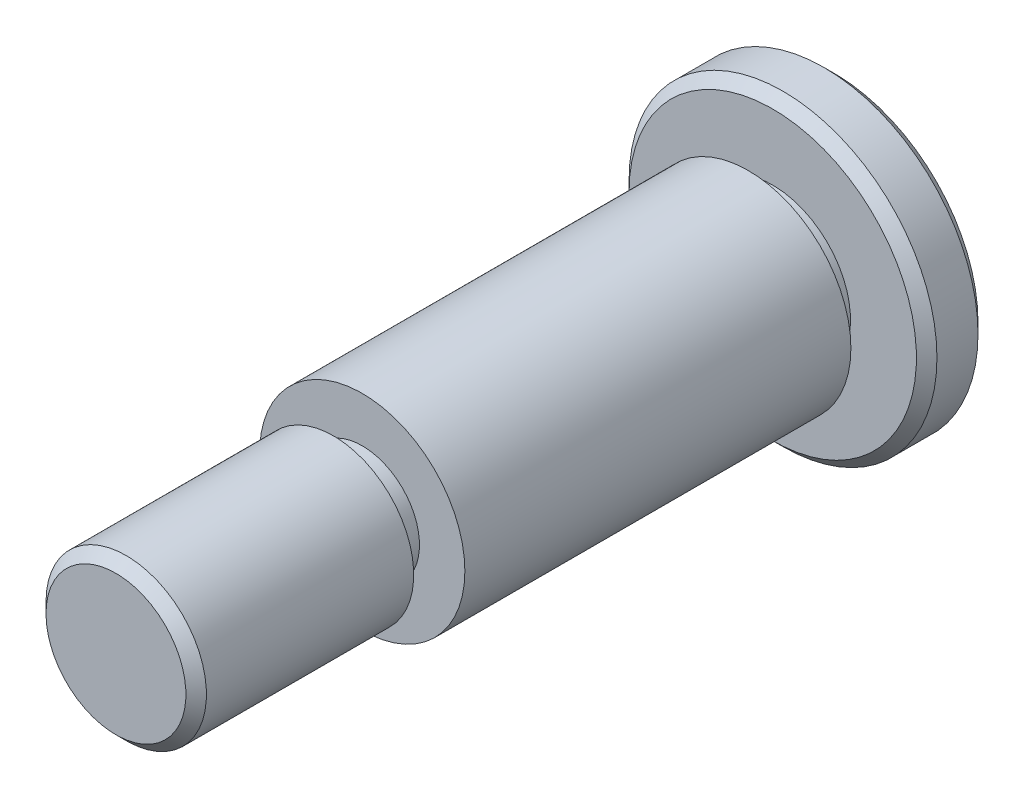
ISO-10303-21;
HEADER;
FILE_DESCRIPTION(('STEP AP214'),'2;1');
FILE_NAME('part.step','',(''),(''),'','','');
FILE_SCHEMA(('AUTOMOTIVE_DESIGN { 1 0 10303 214 1 1 1 1 }'));
ENDSEC;
DATA;
#1=APPLICATION_CONTEXT('core data for automotive mechanical design processes');
#2=APPLICATION_PROTOCOL_DEFINITION('international standard','automotive_design',2000,#1);
#3=PRODUCT_CONTEXT('',#1,'mechanical');
#4=PRODUCT('Part','Part','',(#3));
#5=PRODUCT_RELATED_PRODUCT_CATEGORY('part','',(#4));
#6=PRODUCT_DEFINITION_FORMATION('','',#4);
#7=PRODUCT_DEFINITION_CONTEXT('part definition',#1,'design');
#8=PRODUCT_DEFINITION('design','',#6,#7);
#9=PRODUCT_DEFINITION_SHAPE('','',#8);
#10=(LENGTH_UNIT() NAMED_UNIT(*) SI_UNIT(.MILLI.,.METRE.));
#11=(NAMED_UNIT(*) PLANE_ANGLE_UNIT() SI_UNIT($,.RADIAN.));
#12=(NAMED_UNIT(*) SI_UNIT($,.STERADIAN.) SOLID_ANGLE_UNIT());
#13=UNCERTAINTY_MEASURE_WITH_UNIT(LENGTH_MEASURE(1.E-05),#10,'distance_accuracy_value','');
#14=(GEOMETRIC_REPRESENTATION_CONTEXT(3) GLOBAL_UNCERTAINTY_ASSIGNED_CONTEXT((#13)) GLOBAL_UNIT_ASSIGNED_CONTEXT((#10,
#11,#12)) REPRESENTATION_CONTEXT('',''));
#15=CARTESIAN_POINT('',(0.,0.,0.));
#16=DIRECTION('',(0.,0.,1.));
#17=DIRECTION('',(1.,0.,0.));
#18=AXIS2_PLACEMENT_3D('',#15,#16,#17);
#19=CARTESIAN_POINT('',(0.,0.,-10.0499999999784));
#20=DIRECTION('',(0.,0.,-1.));
#21=DIRECTION('',(-1.,0.,0.));
#22=AXIS2_PLACEMENT_3D('',#19,#20,#21);
#23=CONICAL_SURFACE('',#22,1.25000000002728,1.04719755118804);
#24=CARTESIAN_POINT('',(0.,0.,-10.0499999999784));
#25=DIRECTION('',(0.,0.,-1.));
#26=DIRECTION('',(-1.,0.,0.));
#27=AXIS2_PLACEMENT_3D('',#24,#25,#26);
#28=CIRCLE('',#27,1.25000000002728);
#29=CARTESIAN_POINT('',(0.,-1.24999999997044,-10.0499999999784));
#30=VERTEX_POINT('',#29);
#31=CARTESIAN_POINT('',(1.08253175474236,-0.625000000006819,-10.0499999999892));
#32=VERTEX_POINT('',#31);
#33=EDGE_CURVE('E164',#30,#32,#28,.F.);
#34=ORIENTED_EDGE('',*,*,#33,.F.);
#35=CARTESIAN_POINT('',(0.,0.,-10.0499999999784));
#36=DIRECTION('',(0.,0.,-1.));
#37=DIRECTION('',(-1.,0.,0.));
#38=AXIS2_PLACEMENT_3D('',#35,#36,#37);
#39=CIRCLE('',#38,1.25000000002728);
#40=CARTESIAN_POINT('',(-1.08253175474236,-0.62500000000682,-10.0499999999892));
#41=VERTEX_POINT('',#40);
#42=EDGE_CURVE('E128',#41,#30,#39,.F.);
#43=ORIENTED_EDGE('',*,*,#42,.F.);
#44=CARTESIAN_POINT('',(0.,0.,-10.0499999999784));
#45=DIRECTION('',(0.,0.,-1.));
#46=DIRECTION('',(-1.,0.,0.));
#47=AXIS2_PLACEMENT_3D('',#44,#45,#46);
#48=CIRCLE('',#47,1.25000000002728);
#49=CARTESIAN_POINT('',(-1.08253175474236,0.62500000000682,-10.0499999999892));
#50=VERTEX_POINT('',#49);
#51=EDGE_CURVE('E166',#50,#41,#48,.F.);
#52=ORIENTED_EDGE('',*,*,#51,.F.);
#53=CARTESIAN_POINT('',(0.,0.,-10.0499999999784));
#54=DIRECTION('',(0.,0.,-1.));
#55=DIRECTION('',(-1.,0.,0.));
#56=AXIS2_PLACEMENT_3D('',#53,#54,#55);
#57=CIRCLE('',#56,1.25000000002728);
#58=CARTESIAN_POINT('',(0.,1.25000000001364,-10.0499999999892));
#59=VERTEX_POINT('',#58);
#60=EDGE_CURVE('E95',#59,#50,#57,.F.);
#61=ORIENTED_EDGE('',*,*,#60,.F.);
#62=CARTESIAN_POINT('',(0.,0.,-10.0499999999784));
#63=DIRECTION('',(0.,0.,-1.));
#64=DIRECTION('',(-1.,0.,0.));
#65=AXIS2_PLACEMENT_3D('',#62,#63,#64);
#66=CIRCLE('',#65,1.25000000002728);
#67=CARTESIAN_POINT('',(1.08253175474236,0.62500000000682,-10.0499999999892));
#68=VERTEX_POINT('',#67);
#69=EDGE_CURVE('E91',#68,#59,#66,.F.);
#70=ORIENTED_EDGE('',*,*,#69,.F.);
#71=CARTESIAN_POINT('',(0.,0.,-10.0499999999784));
#72=DIRECTION('',(0.,0.,-1.));
#73=DIRECTION('',(-1.,0.,0.));
#74=AXIS2_PLACEMENT_3D('',#71,#72,#73);
#75=CIRCLE('',#74,1.25000000002728);
#76=EDGE_CURVE('E20',#32,#68,#75,.F.);
#77=ORIENTED_EDGE('',*,*,#76,.F.);
#78=EDGE_LOOP('',(#34,#43,#52,#61,#70,#77));
#79=FACE_BOUND('',#78,.T.);
#80=CARTESIAN_POINT('',(0.,5.6843418860808E-11,-9.32831216351815));
#81=VERTEX_POINT('',#80);
#82=VERTEX_LOOP('',#81);
#83=FACE_BOUND('',#82,.T.);
#84=ADVANCED_FACE('F17',(#79,#83),#23,.F.);
#85=CARTESIAN_POINT('',(-0.721687836487032,1.25,-10.05));
#86=DIRECTION('',(0.,0.,-1.));
#87=DIRECTION('',(-1.,0.,0.));
#88=AXIS2_PLACEMENT_3D('',#85,#86,#87);
#89=PLANE('',#88);
#90=DIRECTION('',(-0.5,0.866025403784439,0.));
#91=VECTOR('',#90,1.);
#92=CARTESIAN_POINT('',(0.721687836487033,1.25,-10.05));
#93=LINE('',#92,#91);
#94=CARTESIAN_POINT('',(1.44337567297406,0.,-10.05));
#95=VERTEX_POINT('',#94);
#96=EDGE_CURVE('E106',#68,#95,#93,.F.);
#97=ORIENTED_EDGE('',*,*,#96,.T.);
#98=DIRECTION('',(0.5,0.866025403784439,0.));
#99=VECTOR('',#98,1.);
#100=CARTESIAN_POINT('',(1.44337567297406,0.,-10.05));
#101=LINE('',#100,#99);
#102=EDGE_CURVE('E112',#95,#32,#101,.F.);
#103=ORIENTED_EDGE('',*,*,#102,.T.);
#104=ORIENTED_EDGE('',*,*,#76,.T.);
#105=EDGE_LOOP('',(#97,#103,#104));
#106=FACE_BOUND('',#105,.T.);
#107=ADVANCED_FACE('F110',(#106),#89,.T.);
#108=CARTESIAN_POINT('',(-0.721687836487032,1.25,-10.05));
#109=DIRECTION('',(0.,0.,-1.));
#110=DIRECTION('',(-1.,0.,0.));
#111=AXIS2_PLACEMENT_3D('',#108,#109,#110);
#112=PLANE('',#111);
#113=DIRECTION('',(-1.,0.,0.));
#114=VECTOR('',#113,1.);
#115=CARTESIAN_POINT('',(-0.721687836487032,1.25,-10.05));
#116=LINE('',#115,#114);
#117=CARTESIAN_POINT('',(0.721687836487033,1.25,-10.05));
#118=VERTEX_POINT('',#117);
#119=EDGE_CURVE('E102',#59,#118,#116,.F.);
#120=ORIENTED_EDGE('',*,*,#119,.T.);
#121=DIRECTION('',(-0.5,0.866025403784439,0.));
#122=VECTOR('',#121,1.);
#123=CARTESIAN_POINT('',(0.721687836487033,1.25,-10.05));
#124=LINE('',#123,#122);
#125=EDGE_CURVE('E100',#118,#68,#124,.F.);
#126=ORIENTED_EDGE('',*,*,#125,.T.);
#127=ORIENTED_EDGE('',*,*,#69,.T.);
#128=EDGE_LOOP('',(#120,#126,#127));
#129=FACE_BOUND('',#128,.T.);
#130=ADVANCED_FACE('F101',(#129),#112,.T.);
#131=CARTESIAN_POINT('',(-0.721687836487032,1.25,-10.05));
#132=DIRECTION('',(0.,0.,-1.));
#133=DIRECTION('',(-1.,0.,0.));
#134=AXIS2_PLACEMENT_3D('',#131,#132,#133);
#135=PLANE('',#134);
#136=DIRECTION('',(-0.5,-0.866025403784439,0.));
#137=VECTOR('',#136,1.);
#138=CARTESIAN_POINT('',(-1.44337567297406,0.,-10.05));
#139=LINE('',#138,#137);
#140=CARTESIAN_POINT('',(-0.721687836487029,1.25,-10.05));
#141=VERTEX_POINT('',#140);
#142=EDGE_CURVE('E172',#50,#141,#139,.F.);
#143=ORIENTED_EDGE('',*,*,#142,.T.);
#144=DIRECTION('',(-1.,0.,0.));
#145=VECTOR('',#144,1.);
#146=CARTESIAN_POINT('',(-0.721687836487032,1.25,-10.05));
#147=LINE('',#146,#145);
#148=EDGE_CURVE('E119',#141,#59,#147,.F.);
#149=ORIENTED_EDGE('',*,*,#148,.T.);
#150=ORIENTED_EDGE('',*,*,#60,.T.);
#151=EDGE_LOOP('',(#143,#149,#150));
#152=FACE_BOUND('',#151,.T.);
#153=ADVANCED_FACE('F171',(#152),#135,.T.);
#154=CARTESIAN_POINT('',(-0.721687836487032,1.25,-10.05));
#155=DIRECTION('',(0.,0.,-1.));
#156=DIRECTION('',(-1.,0.,0.));
#157=AXIS2_PLACEMENT_3D('',#154,#155,#156);
#158=PLANE('',#157);
#159=DIRECTION('',(0.5,-0.866025403784438,0.));
#160=VECTOR('',#159,1.);
#161=CARTESIAN_POINT('',(-0.721687836487032,-1.25,-10.05));
#162=LINE('',#161,#160);
#163=CARTESIAN_POINT('',(-1.44337567297406,0.,-10.05));
#164=VERTEX_POINT('',#163);
#165=EDGE_CURVE('E236',#41,#164,#162,.F.);
#166=ORIENTED_EDGE('',*,*,#165,.T.);
#167=DIRECTION('',(-0.5,-0.866025403784439,0.));
#168=VECTOR('',#167,1.);
#169=CARTESIAN_POINT('',(-1.44337567297406,0.,-10.05));
#170=LINE('',#169,#168);
#171=EDGE_CURVE('E179',#164,#50,#170,.F.);
#172=ORIENTED_EDGE('',*,*,#171,.T.);
#173=ORIENTED_EDGE('',*,*,#51,.T.);
#174=EDGE_LOOP('',(#166,#172,#173));
#175=FACE_BOUND('',#174,.T.);
#176=ADVANCED_FACE('F489',(#175),#158,.T.);
#177=CARTESIAN_POINT('',(-0.721687836487032,1.25,-10.05));
#178=DIRECTION('',(0.,0.,-1.));
#179=DIRECTION('',(-1.,0.,0.));
#180=AXIS2_PLACEMENT_3D('',#177,#178,#179);
#181=PLANE('',#180);
#182=DIRECTION('',(0.5,0.866025403784439,0.));
#183=VECTOR('',#182,1.);
#184=CARTESIAN_POINT('',(1.44337567297406,0.,-10.05));
#185=LINE('',#184,#183);
#186=CARTESIAN_POINT('',(0.721687836487032,-1.25,-10.05));
#187=VERTEX_POINT('',#186);
#188=EDGE_CURVE('E107',#32,#187,#185,.F.);
#189=ORIENTED_EDGE('',*,*,#188,.T.);
#190=DIRECTION('',(1.,0.,0.));
#191=VECTOR('',#190,1.);
#192=CARTESIAN_POINT('',(0.721687836487033,-1.25,-10.05));
#193=LINE('',#192,#191);
#194=EDGE_CURVE('E224',#187,#30,#193,.F.);
#195=ORIENTED_EDGE('',*,*,#194,.T.);
#196=ORIENTED_EDGE('',*,*,#33,.T.);
#197=EDGE_LOOP('',(#189,#195,#196));
#198=FACE_BOUND('',#197,.T.);
#199=ADVANCED_FACE('F480',(#198),#181,.T.);
#200=CARTESIAN_POINT('',(-0.721687836487032,1.25,-10.05));
#201=DIRECTION('',(0.,0.,-1.));
#202=DIRECTION('',(-1.,0.,0.));
#203=AXIS2_PLACEMENT_3D('',#200,#201,#202);
#204=PLANE('',#203);
#205=DIRECTION('',(1.,0.,0.));
#206=VECTOR('',#205,1.);
#207=CARTESIAN_POINT('',(0.721687836487033,-1.25,-10.05));
#208=LINE('',#207,#206);
#209=CARTESIAN_POINT('',(-0.721687836487032,-1.25,-10.05));
#210=VERTEX_POINT('',#209);
#211=EDGE_CURVE('E227',#30,#210,#208,.F.);
#212=ORIENTED_EDGE('',*,*,#211,.T.);
#213=DIRECTION('',(0.5,-0.866025403784438,0.));
#214=VECTOR('',#213,1.);
#215=CARTESIAN_POINT('',(-0.721687836487032,-1.25,-10.05));
#216=LINE('',#215,#214);
#217=EDGE_CURVE('E184',#210,#41,#216,.F.);
#218=ORIENTED_EDGE('',*,*,#217,.T.);
#219=ORIENTED_EDGE('',*,*,#42,.T.);
#220=EDGE_LOOP('',(#212,#218,#219));
#221=FACE_BOUND('',#220,.T.);
#222=ADVANCED_FACE('F471',(#221),#204,.T.);
#223=CARTESIAN_POINT('',(1.44337567297406,0.,-11.75));
#224=DIRECTION('',(0.866025403784439,-0.5,0.));
#225=DIRECTION('',(0.5,0.866025403784439,0.));
#226=AXIS2_PLACEMENT_3D('',#223,#224,#225);
#227=PLANE('',#226);
#228=ORIENTED_EDGE('',*,*,#188,.F.);
#229=ORIENTED_EDGE('',*,*,#102,.F.);
#230=DIRECTION('',(0.,0.,1.));
#231=VECTOR('',#230,1.);
#232=CARTESIAN_POINT('',(1.44337567297406,0.,-11.75));
#233=LINE('',#232,#231);
#234=CARTESIAN_POINT('',(1.44337567297406,0.,-11.5));
#235=VERTEX_POINT('',#234);
#236=EDGE_CURVE('E117',#95,#235,#233,.F.);
#237=ORIENTED_EDGE('',*,*,#236,.T.);
#238=DIRECTION('',(0.499999999999997,0.86602540378444,0.));
#239=VECTOR('',#238,1.);
#240=CARTESIAN_POINT('',(0.721687836487033,-1.25,-11.5));
#241=LINE('',#240,#239);
#242=CARTESIAN_POINT('',(0.721687836487033,-1.25,-11.5));
#243=VERTEX_POINT('',#242);
#244=EDGE_CURVE('E219',#243,#235,#241,.T.);
#245=ORIENTED_EDGE('',*,*,#244,.F.);
#246=DIRECTION('',(0.,0.,-1.));
#247=VECTOR('',#246,1.);
#248=CARTESIAN_POINT('',(0.721687836487033,-1.25,-11.75));
#249=LINE('',#248,#247);
#250=EDGE_CURVE('E228',#243,#187,#249,.F.);
#251=ORIENTED_EDGE('',*,*,#250,.T.);
#252=EDGE_LOOP('',(#228,#229,#237,#245,#251));
#253=FACE_BOUND('',#252,.T.);
#254=ADVANCED_FACE('F463',(#253),#227,.F.);
#255=CARTESIAN_POINT('',(0.721687836487033,1.25,-11.75));
#256=DIRECTION('',(0.866025403784439,0.5,0.));
#257=DIRECTION('',(-0.5,0.866025403784439,0.));
#258=AXIS2_PLACEMENT_3D('',#255,#256,#257);
#259=PLANE('',#258);
#260=ORIENTED_EDGE('',*,*,#96,.F.);
#261=ORIENTED_EDGE('',*,*,#125,.F.);
#262=DIRECTION('',(0.,0.,1.));
#263=VECTOR('',#262,1.);
#264=CARTESIAN_POINT('',(0.721687836487033,1.25,-11.75));
#265=LINE('',#264,#263);
#266=CARTESIAN_POINT('',(0.721687836487033,1.25,-11.5));
#267=VERTEX_POINT('',#266);
#268=EDGE_CURVE('E186',#118,#267,#265,.F.);
#269=ORIENTED_EDGE('',*,*,#268,.T.);
#270=DIRECTION('',(-0.499999999999998,0.86602540378444,0.));
#271=VECTOR('',#270,1.);
#272=CARTESIAN_POINT('',(1.44337567297406,0.,-11.5));
#273=LINE('',#272,#271);
#274=EDGE_CURVE('E205',#235,#267,#273,.T.);
#275=ORIENTED_EDGE('',*,*,#274,.F.);
#276=ORIENTED_EDGE('',*,*,#236,.F.);
#277=EDGE_LOOP('',(#260,#261,#269,#275,#276));
#278=FACE_BOUND('',#277,.T.);
#279=ADVANCED_FACE('F115',(#278),#259,.F.);
#280=CARTESIAN_POINT('',(-0.721687836487032,1.25,-11.75));
#281=DIRECTION('',(0.,1.,0.));
#282=DIRECTION('',(-1.,0.,0.));
#283=AXIS2_PLACEMENT_3D('',#280,#281,#282);
#284=PLANE('',#283);
#285=ORIENTED_EDGE('',*,*,#119,.F.);
#286=ORIENTED_EDGE('',*,*,#148,.F.);
#287=DIRECTION('',(0.,0.,1.));
#288=VECTOR('',#287,1.);
#289=CARTESIAN_POINT('',(-0.721687836487029,1.25,-11.75));
#290=LINE('',#289,#288);
#291=CARTESIAN_POINT('',(-0.721687836487031,1.25,-11.5));
#292=VERTEX_POINT('',#291);
#293=EDGE_CURVE('E182',#141,#292,#290,.F.);
#294=ORIENTED_EDGE('',*,*,#293,.T.);
#295=DIRECTION('',(-1.,0.,0.));
#296=VECTOR('',#295,1.);
#297=CARTESIAN_POINT('',(0.,1.25,-11.5));
#298=LINE('',#297,#296);
#299=EDGE_CURVE('E209',#267,#292,#298,.T.);
#300=ORIENTED_EDGE('',*,*,#299,.F.);
#301=ORIENTED_EDGE('',*,*,#268,.F.);
#302=EDGE_LOOP('',(#285,#286,#294,#300,#301));
#303=FACE_BOUND('',#302,.T.);
#304=ADVANCED_FACE('F210',(#303),#284,.F.);
#305=CARTESIAN_POINT('',(-1.44337567297406,0.,-11.75));
#306=DIRECTION('',(-0.866025403784439,0.5,0.));
#307=DIRECTION('',(-0.5,-0.866025403784439,0.));
#308=AXIS2_PLACEMENT_3D('',#305,#306,#307);
#309=PLANE('',#308);
#310=ORIENTED_EDGE('',*,*,#142,.F.);
#311=ORIENTED_EDGE('',*,*,#171,.F.);
#312=DIRECTION('',(0.,0.,1.));
#313=VECTOR('',#312,1.);
#314=CARTESIAN_POINT('',(-1.44337567297406,0.,-11.75));
#315=LINE('',#314,#313);
#316=CARTESIAN_POINT('',(-1.44337567297406,0.,-11.5));
#317=VERTEX_POINT('',#316);
#318=EDGE_CURVE('E244',#164,#317,#315,.F.);
#319=ORIENTED_EDGE('',*,*,#318,.T.);
#320=DIRECTION('',(-0.499999999999998,-0.86602540378444,0.));
#321=VECTOR('',#320,1.);
#322=CARTESIAN_POINT('',(-0.721687836487032,1.25,-11.5));
#323=LINE('',#322,#321);
#324=EDGE_CURVE('E213',#292,#317,#323,.T.);
#325=ORIENTED_EDGE('',*,*,#324,.F.);
#326=ORIENTED_EDGE('',*,*,#293,.F.);
#327=EDGE_LOOP('',(#310,#311,#319,#325,#326));
#328=FACE_BOUND('',#327,.T.);
#329=ADVANCED_FACE('F177',(#328),#309,.F.);
#330=CARTESIAN_POINT('',(-0.721687836487032,-1.25,-11.75));
#331=DIRECTION('',(-0.866025403784438,-0.5,0.));
#332=DIRECTION('',(0.5,-0.866025403784438,0.));
#333=AXIS2_PLACEMENT_3D('',#330,#331,#332);
#334=PLANE('',#333);
#335=ORIENTED_EDGE('',*,*,#165,.F.);
#336=ORIENTED_EDGE('',*,*,#217,.F.);
#337=DIRECTION('',(0.,0.,-1.));
#338=VECTOR('',#337,1.);
#339=CARTESIAN_POINT('',(-0.721687836487032,-1.25,-11.75));
#340=LINE('',#339,#338);
#341=CARTESIAN_POINT('',(-0.721687836487032,-1.25,-11.5));
#342=VERTEX_POINT('',#341);
#343=EDGE_CURVE('E35',#210,#342,#340,.T.);
#344=ORIENTED_EDGE('',*,*,#343,.T.);
#345=DIRECTION('',(0.499999999999998,-0.86602540378444,0.));
#346=VECTOR('',#345,1.);
#347=CARTESIAN_POINT('',(-1.44337567297406,0.,-11.5));
#348=LINE('',#347,#346);
#349=EDGE_CURVE('E253',#317,#342,#348,.T.);
#350=ORIENTED_EDGE('',*,*,#349,.F.);
#351=ORIENTED_EDGE('',*,*,#318,.F.);
#352=EDGE_LOOP('',(#335,#336,#344,#350,#351));
#353=FACE_BOUND('',#352,.T.);
#354=ADVANCED_FACE('F261',(#353),#334,.F.);
#355=CARTESIAN_POINT('',(0.721687836487033,-1.25,-11.75));
#356=DIRECTION('',(0.,-1.,0.));
#357=DIRECTION('',(0.,0.,-1.));
#358=AXIS2_PLACEMENT_3D('',#355,#356,#357);
#359=PLANE('',#358);
#360=ORIENTED_EDGE('',*,*,#211,.F.);
#361=ORIENTED_EDGE('',*,*,#194,.F.);
#362=ORIENTED_EDGE('',*,*,#250,.F.);
#363=DIRECTION('',(-1.,0.,0.));
#364=VECTOR('',#363,1.);
#365=CARTESIAN_POINT('',(0.,-1.25,-11.5));
#366=LINE('',#365,#364);
#367=EDGE_CURVE('E161',#342,#243,#366,.F.);
#368=ORIENTED_EDGE('',*,*,#367,.F.);
#369=ORIENTED_EDGE('',*,*,#343,.F.);
#370=EDGE_LOOP('',(#360,#361,#362,#368,#369));
#371=FACE_BOUND('',#370,.T.);
#372=ADVANCED_FACE('F293',(#371),#359,.F.);
#373=CARTESIAN_POINT('',(0.,0.,-11.5));
#374=DIRECTION('',(0.,0.,-1.));
#375=DIRECTION('',(-1.,0.,0.));
#376=AXIS2_PLACEMENT_3D('',#373,#374,#375);
#377=PLANE('',#376);
#378=ORIENTED_EDGE('',*,*,#349,.T.);
#379=ORIENTED_EDGE('',*,*,#367,.T.);
#380=ORIENTED_EDGE('',*,*,#244,.T.);
#381=ORIENTED_EDGE('',*,*,#274,.T.);
#382=ORIENTED_EDGE('',*,*,#299,.T.);
#383=ORIENTED_EDGE('',*,*,#324,.T.);
#384=EDGE_LOOP('',(#378,#379,#380,#381,#382,#383));
#385=FACE_BOUND('',#384,.T.);
#386=CARTESIAN_POINT('',(0.,0.,-11.4999999999554));
#387=DIRECTION('',(0.,0.,1.));
#388=DIRECTION('',(1.,0.,0.));
#389=AXIS2_PLACEMENT_3D('',#386,#387,#388);
#390=CIRCLE('',#389,3.50000000003092);
#391=CARTESIAN_POINT('',(3.50000000003092,0.,-11.4999999999554));
#392=VERTEX_POINT('',#391);
#393=EDGE_CURVE('E158',#392,#392,#390,.T.);
#394=ORIENTED_EDGE('',*,*,#393,.F.);
#395=EDGE_LOOP('',(#394));
#396=FACE_BOUND('',#395,.T.);
#397=ADVANCED_FACE('F216',(#385,#396),#377,.T.);
#398=CARTESIAN_POINT('',(0.,0.,6.));
#399=DIRECTION('',(0.,0.,1.));
#400=DIRECTION('',(1.,0.,0.));
#401=AXIS2_PLACEMENT_3D('',#398,#399,#400);
#402=PLANE('',#401);
#403=CARTESIAN_POINT('',(0.,0.,6.00000000002865));
#404=DIRECTION('',(0.,0.,-1.));
#405=DIRECTION('',(-1.,0.,0.));
#406=AXIS2_PLACEMENT_3D('',#403,#404,#405);
#407=CIRCLE('',#406,1.70399999996107);
#408=CARTESIAN_POINT('',(-1.70399999996107,0.,6.00000000002865));
#409=VERTEX_POINT('',#408);
#410=EDGE_CURVE('E154',#409,#409,#407,.T.);
#411=ORIENTED_EDGE('',*,*,#410,.F.);
#412=EDGE_LOOP('',(#411));
#413=FACE_BOUND('',#412,.T.);
#414=ADVANCED_FACE('F283',(#413),#402,.T.);
#415=CARTESIAN_POINT('',(0.,0.,-11.250000000075));
#416=DIRECTION('',(0.,0.,1.));
#417=DIRECTION('',(1.,0.,0.));
#418=AXIS2_PLACEMENT_3D('',#415,#416,#417);
#419=CONICAL_SURFACE('',#418,3.74999999991132,0.785398163397448);
#420=CARTESIAN_POINT('',(0.,0.,-11.25));
#421=DIRECTION('',(0.,0.,1.));
#422=DIRECTION('',(1.,0.,0.));
#423=AXIS2_PLACEMENT_3D('',#420,#421,#422);
#424=CIRCLE('',#423,3.75);
#425=CARTESIAN_POINT('',(3.75,0.,-11.25));
#426=VERTEX_POINT('',#425);
#427=EDGE_CURVE('E157',#426,#426,#424,.T.);
#428=ORIENTED_EDGE('',*,*,#427,.F.);
#429=EDGE_LOOP('',(#428));
#430=FACE_BOUND('',#429,.T.);
#431=ORIENTED_EDGE('',*,*,#393,.T.);
#432=EDGE_LOOP('',(#431));
#433=FACE_BOUND('',#432,.T.);
#434=ADVANCED_FACE('F279',(#430,#433),#419,.T.);
#435=CARTESIAN_POINT('',(0.,0.,5.74999999997772));
#436=DIRECTION('',(0.,0.,-1.));
#437=DIRECTION('',(-1.,0.,0.));
#438=AXIS2_PLACEMENT_3D('',#435,#436,#437);
#439=CONICAL_SURFACE('',#438,1.954000000012,0.785398163397448);
#440=CARTESIAN_POINT('',(0.,0.,5.75));
#441=DIRECTION('',(0.,0.,-1.));
#442=DIRECTION('',(-1.,0.,0.));
#443=AXIS2_PLACEMENT_3D('',#440,#441,#442);
#444=CIRCLE('',#443,1.954);
#445=CARTESIAN_POINT('',(-1.954,0.,5.75));
#446=VERTEX_POINT('',#445);
#447=EDGE_CURVE('E266',#446,#446,#444,.T.);
#448=ORIENTED_EDGE('',*,*,#447,.F.);
#449=EDGE_LOOP('',(#448));
#450=FACE_BOUND('',#449,.T.);
#451=ORIENTED_EDGE('',*,*,#410,.T.);
#452=EDGE_LOOP('',(#451));
#453=FACE_BOUND('',#452,.T.);
#454=ADVANCED_FACE('F275',(#450,#453),#439,.T.);
#455=CARTESIAN_POINT('',(0.,0.,-11.25));
#456=DIRECTION('',(0.,0.,1.));
#457=DIRECTION('',(1.,0.,0.));
#458=AXIS2_PLACEMENT_3D('',#455,#456,#457);
#459=CYLINDRICAL_SURFACE('',#458,3.75);
#460=CARTESIAN_POINT('',(0.,0.,-10.249999999985));
#461=DIRECTION('',(0.,0.,-1.));
#462=DIRECTION('',(-1.,0.,0.));
#463=AXIS2_PLACEMENT_3D('',#460,#461,#462);
#464=CIRCLE('',#463,3.74999999996817);
#465=CARTESIAN_POINT('',(-3.74999999996817,0.,-10.249999999985));
#466=VERTEX_POINT('',#465);
#467=EDGE_CURVE('E153',#466,#466,#464,.F.);
#468=ORIENTED_EDGE('',*,*,#467,.F.);
#469=EDGE_LOOP('',(#468));
#470=FACE_BOUND('',#469,.T.);
#471=ORIENTED_EDGE('',*,*,#427,.T.);
#472=EDGE_LOOP('',(#471));
#473=FACE_BOUND('',#472,.T.);
#474=ADVANCED_FACE('F278',(#470,#473),#459,.T.);
#475=CARTESIAN_POINT('',(0.,0.,6.));
#476=DIRECTION('',(0.,0.,-1.));
#477=DIRECTION('',(-1.,0.,0.));
#478=AXIS2_PLACEMENT_3D('',#475,#476,#477);
#479=CYLINDRICAL_SURFACE('',#478,1.954);
#480=ORIENTED_EDGE('',*,*,#447,.T.);
#481=EDGE_LOOP('',(#480));
#482=FACE_BOUND('',#481,.T.);
#483=CARTESIAN_POINT('',(0.,0.,0.7));
#484=DIRECTION('',(0.,0.,-1.));
#485=DIRECTION('',(-1.,0.,0.));
#486=AXIS2_PLACEMENT_3D('',#483,#484,#485);
#487=CIRCLE('',#486,1.954);
#488=CARTESIAN_POINT('',(-1.954,0.,0.7));
#489=VERTEX_POINT('',#488);
#490=EDGE_CURVE('E150',#489,#489,#487,.F.);
#491=ORIENTED_EDGE('',*,*,#490,.T.);
#492=EDGE_LOOP('',(#491));
#493=FACE_BOUND('',#492,.T.);
#494=ADVANCED_FACE('F272',(#482,#493),#479,.T.);
#495=CARTESIAN_POINT('',(0.,0.,-10.2499999998713));
#496=DIRECTION('',(0.,0.,-1.));
#497=DIRECTION('',(-1.,0.,0.));
#498=AXIS2_PLACEMENT_3D('',#495,#496,#497);
#499=CONICAL_SURFACE('',#498,3.74999999991132,0.785398163511135);
#500=ORIENTED_EDGE('',*,*,#467,.T.);
#501=EDGE_LOOP('',(#500));
#502=FACE_BOUND('',#501,.T.);
#503=CARTESIAN_POINT('',(0.,0.,-9.99999999999091));
#504=DIRECTION('',(0.,0.,-1.));
#505=DIRECTION('',(-1.,0.,0.));
#506=AXIS2_PLACEMENT_3D('',#503,#504,#505);
#507=CIRCLE('',#506,3.49999999997408);
#508=CARTESIAN_POINT('',(-3.49999999997408,0.,-9.99999999999091));
#509=VERTEX_POINT('',#508);
#510=EDGE_CURVE('E147',#509,#509,#507,.T.);
#511=ORIENTED_EDGE('',*,*,#510,.T.);
#512=EDGE_LOOP('',(#511));
#513=FACE_BOUND('',#512,.T.);
#514=ADVANCED_FACE('F326',(#502,#513),#499,.T.);
#515=CARTESIAN_POINT('',(0.,0.,0.7));
#516=DIRECTION('',(0.,0.,1.));
#517=DIRECTION('',(1.,0.,0.));
#518=AXIS2_PLACEMENT_3D('',#515,#516,#517);
#519=PLANE('',#518);
#520=CARTESIAN_POINT('',(0.,0.,0.699999999999999));
#521=DIRECTION('',(0.,0.,-1.));
#522=DIRECTION('',(-1.,0.,0.));
#523=AXIS2_PLACEMENT_3D('',#520,#521,#522);
#524=CIRCLE('',#523,1.3938);
#525=CARTESIAN_POINT('',(-1.3938,0.,0.699999999999999));
#526=VERTEX_POINT('',#525);
#527=EDGE_CURVE('E144',#526,#526,#524,.T.);
#528=ORIENTED_EDGE('',*,*,#527,.F.);
#529=EDGE_LOOP('',(#528));
#530=FACE_BOUND('',#529,.T.);
#531=ORIENTED_EDGE('',*,*,#490,.F.);
#532=EDGE_LOOP('',(#531));
#533=FACE_BOUND('',#532,.T.);
#534=ADVANCED_FACE('F322',(#530,#533),#519,.F.);
#535=CARTESIAN_POINT('',(0.,0.,-10.));
#536=DIRECTION('',(0.,0.,-1.));
#537=DIRECTION('',(-1.,0.,0.));
#538=AXIS2_PLACEMENT_3D('',#535,#536,#537);
#539=PLANE('',#538);
#540=CARTESIAN_POINT('',(0.,0.,-10.));
#541=DIRECTION('',(0.,0.,-1.));
#542=DIRECTION('',(-1.,0.,0.));
#543=AXIS2_PLACEMENT_3D('',#540,#541,#542);
#544=CIRCLE('',#543,1.8938);
#545=CARTESIAN_POINT('',(-1.8938,0.,-10.));
#546=VERTEX_POINT('',#545);
#547=EDGE_CURVE('E141',#546,#546,#544,.F.);
#548=ORIENTED_EDGE('',*,*,#547,.F.);
#549=EDGE_LOOP('',(#548));
#550=FACE_BOUND('',#549,.T.);
#551=ORIENTED_EDGE('',*,*,#510,.F.);
#552=EDGE_LOOP('',(#551));
#553=FACE_BOUND('',#552,.T.);
#554=ADVANCED_FACE('F318',(#550,#553),#539,.F.);
#555=CARTESIAN_POINT('',(0.,0.,-8.));
#556=DIRECTION('',(0.,0.,-1.));
#557=DIRECTION('',(-1.,0.,0.));
#558=AXIS2_PLACEMENT_3D('',#555,#556,#557);
#559=CYLINDRICAL_SURFACE('',#558,1.3938);
#560=ORIENTED_EDGE('',*,*,#527,.T.);
#561=EDGE_LOOP('',(#560));
#562=FACE_BOUND('',#561,.T.);
#563=CARTESIAN_POINT('',(0.,0.,0.));
#564=DIRECTION('',(0.,0.,-1.));
#565=DIRECTION('',(-1.,0.,0.));
#566=AXIS2_PLACEMENT_3D('',#563,#564,#565);
#567=CIRCLE('',#566,1.3938);
#568=CARTESIAN_POINT('',(-1.3938,0.,0.));
#569=VERTEX_POINT('',#568);
#570=EDGE_CURVE('E138',#569,#569,#567,.T.);
#571=ORIENTED_EDGE('',*,*,#570,.F.);
#572=EDGE_LOOP('',(#571));
#573=FACE_BOUND('',#572,.T.);
#574=ADVANCED_FACE('F314',(#562,#573),#559,.T.);
#575=CARTESIAN_POINT('',(0.,0.,-10.));
#576=DIRECTION('',(0.,0.,-1.));
#577=DIRECTION('',(-1.,0.,0.));
#578=AXIS2_PLACEMENT_3D('',#575,#576,#577);
#579=CYLINDRICAL_SURFACE('',#578,1.8938);
#580=CARTESIAN_POINT('',(0.,0.,-9.4038));
#581=DIRECTION('',(0.,0.,-1.));
#582=DIRECTION('',(-1.,0.,0.));
#583=AXIS2_PLACEMENT_3D('',#580,#581,#582);
#584=CIRCLE('',#583,1.8938);
#585=CARTESIAN_POINT('',(-1.8938,0.,-9.4038));
#586=VERTEX_POINT('',#585);
#587=EDGE_CURVE('E135',#586,#586,#584,.T.);
#588=ORIENTED_EDGE('',*,*,#587,.T.);
#589=EDGE_LOOP('',(#588));
#590=FACE_BOUND('',#589,.T.);
#591=ORIENTED_EDGE('',*,*,#547,.T.);
#592=EDGE_LOOP('',(#591));
#593=FACE_BOUND('',#592,.T.);
#594=ADVANCED_FACE('F310',(#590,#593),#579,.T.);
#595=CARTESIAN_POINT('',(0.,0.,0.));
#596=DIRECTION('',(0.,0.,1.));
#597=DIRECTION('',(1.,0.,0.));
#598=AXIS2_PLACEMENT_3D('',#595,#596,#597);
#599=PLANE('',#598);
#600=ORIENTED_EDGE('',*,*,#570,.T.);
#601=EDGE_LOOP('',(#600));
#602=FACE_BOUND('',#601,.T.);
#603=CARTESIAN_POINT('',(0.,0.,0.));
#604=DIRECTION('',(0.,0.,1.));
#605=DIRECTION('',(1.,0.,0.));
#606=AXIS2_PLACEMENT_3D('',#603,#604,#605);
#607=CIRCLE('',#606,2.5);
#608=CARTESIAN_POINT('',(2.5,0.,0.));
#609=VERTEX_POINT('',#608);
#610=EDGE_CURVE('E26',#609,#609,#607,.F.);
#611=ORIENTED_EDGE('',*,*,#610,.F.);
#612=EDGE_LOOP('',(#611));
#613=FACE_BOUND('',#612,.T.);
#614=ADVANCED_FACE('F303',(#602,#613),#599,.T.);
#615=CARTESIAN_POINT('',(0.,2.5,-9.4038));
#616=DIRECTION('',(0.,0.,1.));
#617=DIRECTION('',(1.,0.,0.));
#618=AXIS2_PLACEMENT_3D('',#615,#616,#617);
#619=PLANE('',#618);
#620=ORIENTED_EDGE('',*,*,#587,.F.);
#621=EDGE_LOOP('',(#620));
#622=FACE_BOUND('',#621,.T.);
#623=CARTESIAN_POINT('',(0.,0.,-9.4038));
#624=DIRECTION('',(0.,0.,1.));
#625=DIRECTION('',(1.,0.,0.));
#626=AXIS2_PLACEMENT_3D('',#623,#624,#625);
#627=CIRCLE('',#626,2.5);
#628=CARTESIAN_POINT('',(2.5,0.,-9.4038));
#629=VERTEX_POINT('',#628);
#630=EDGE_CURVE('E11',#629,#629,#627,.T.);
#631=ORIENTED_EDGE('',*,*,#630,.F.);
#632=EDGE_LOOP('',(#631));
#633=FACE_BOUND('',#632,.T.);
#634=ADVANCED_FACE('F297',(#622,#633),#619,.F.);
#635=CARTESIAN_POINT('',(0.,0.,-8.));
#636=DIRECTION('',(0.,0.,1.));
#637=DIRECTION('',(1.,0.,0.));
#638=AXIS2_PLACEMENT_3D('',#635,#636,#637);
#639=CYLINDRICAL_SURFACE('',#638,2.5);
#640=ORIENTED_EDGE('',*,*,#630,.T.);
#641=EDGE_LOOP('',(#640));
#642=FACE_BOUND('',#641,.T.);
#643=ORIENTED_EDGE('',*,*,#610,.T.);
#644=EDGE_LOOP('',(#643));
#645=FACE_BOUND('',#644,.T.);
#646=ADVANCED_FACE('F295',(#642,#645),#639,.T.);
#647=CLOSED_SHELL('',(#84,#107,#130,#153,#176,#199,#222,#254,#279,#304,#329,#354,#372,#397,#414,
#434,#454,#474,#494,#514,#534,#554,#574,#594,#614,#634,#646));
#648=MANIFOLD_SOLID_BREP('B1',#647);
#649=ADVANCED_BREP_SHAPE_REPRESENTATION('',(#18,#648),#14);
#650=SHAPE_DEFINITION_REPRESENTATION(#9,#649);
ENDSEC;
END-ISO-10303-21;
